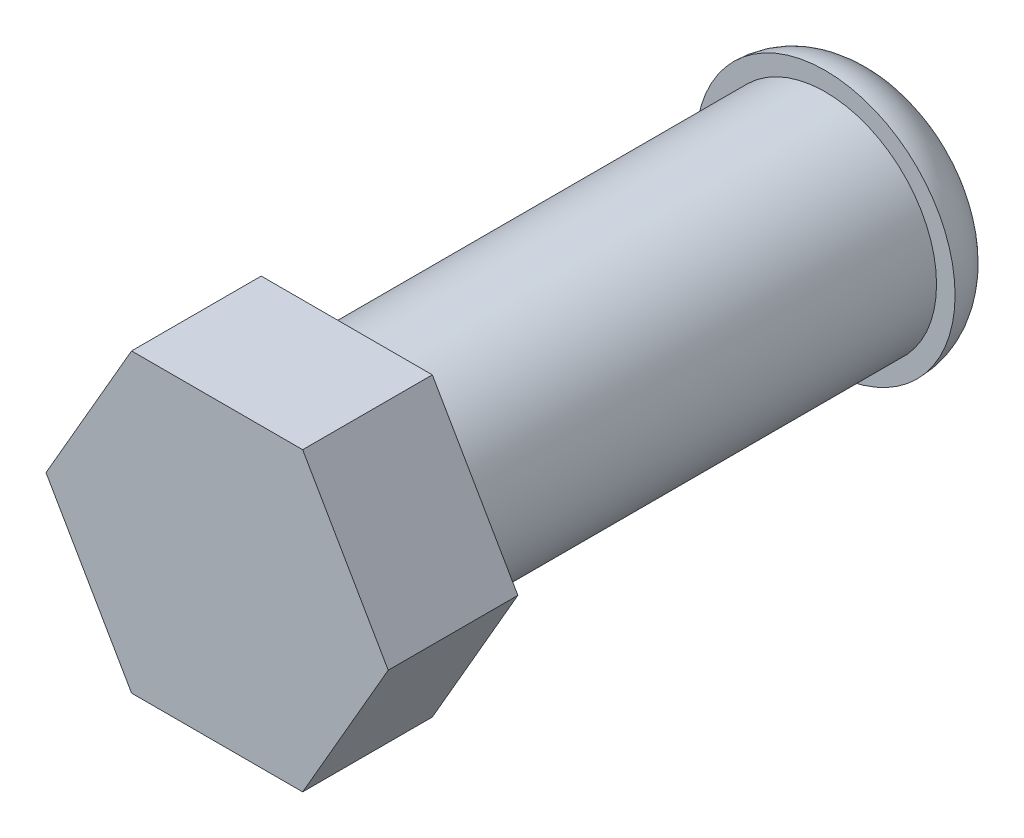
ISO-10303-21;
HEADER;
FILE_DESCRIPTION(('STEP AP214'),'2;1');
FILE_NAME('part.step','',(''),(''),'','','');
FILE_SCHEMA(('AUTOMOTIVE_DESIGN { 1 0 10303 214 1 1 1 1 }'));
ENDSEC;
DATA;
#1=APPLICATION_CONTEXT('core data for automotive mechanical design processes');
#2=APPLICATION_PROTOCOL_DEFINITION('international standard','automotive_design',2000,#1);
#3=PRODUCT_CONTEXT('',#1,'mechanical');
#4=PRODUCT('Part','Part','',(#3));
#5=PRODUCT_RELATED_PRODUCT_CATEGORY('part','',(#4));
#6=PRODUCT_DEFINITION_FORMATION('','',#4);
#7=PRODUCT_DEFINITION_CONTEXT('part definition',#1,'design');
#8=PRODUCT_DEFINITION('design','',#6,#7);
#9=PRODUCT_DEFINITION_SHAPE('','',#8);
#10=(LENGTH_UNIT() NAMED_UNIT(*) SI_UNIT(.MILLI.,.METRE.));
#11=(NAMED_UNIT(*) PLANE_ANGLE_UNIT() SI_UNIT($,.RADIAN.));
#12=(NAMED_UNIT(*) SI_UNIT($,.STERADIAN.) SOLID_ANGLE_UNIT());
#13=UNCERTAINTY_MEASURE_WITH_UNIT(LENGTH_MEASURE(1.E-05),#10,'distance_accuracy_value','');
#14=(GEOMETRIC_REPRESENTATION_CONTEXT(3) GLOBAL_UNCERTAINTY_ASSIGNED_CONTEXT((#13)) GLOBAL_UNIT_ASSIGNED_CONTEXT((#10,
#11,#12)) REPRESENTATION_CONTEXT('',''));
#15=CARTESIAN_POINT('',(0.,0.,0.));
#16=DIRECTION('',(0.,0.,1.));
#17=DIRECTION('',(1.,0.,0.));
#18=AXIS2_PLACEMENT_3D('',#15,#16,#17);
#19=CARTESIAN_POINT('',(0.,0.,25.84));
#20=DIRECTION('',(0.,0.,-1.));
#21=DIRECTION('',(-1.,0.,0.));
#22=AXIS2_PLACEMENT_3D('',#19,#20,#21);
#23=CYLINDRICAL_SURFACE('',#22,6.);
#24=CARTESIAN_POINT('',(0.,0.,25.84));
#25=DIRECTION('',(0.,0.,1.));
#26=DIRECTION('',(1.,0.,0.));
#27=AXIS2_PLACEMENT_3D('',#24,#25,#26);
#28=CIRCLE('',#27,6.);
#29=CARTESIAN_POINT('',(6.,0.,25.84));
#30=VERTEX_POINT('',#29);
#31=EDGE_CURVE('E43',#30,#30,#28,.T.);
#32=ORIENTED_EDGE('',*,*,#31,.F.);
#33=EDGE_LOOP('',(#32));
#34=FACE_BOUND('',#33,.T.);
#35=CARTESIAN_POINT('',(0.,0.,0.));
#36=DIRECTION('',(0.,0.,1.));
#37=DIRECTION('',(1.,0.,0.));
#38=AXIS2_PLACEMENT_3D('',#35,#36,#37);
#39=CIRCLE('',#38,6.);
#40=CARTESIAN_POINT('',(6.,0.,0.));
#41=VERTEX_POINT('',#40);
#42=EDGE_CURVE('E124',#41,#41,#39,.T.);
#43=ORIENTED_EDGE('',*,*,#42,.T.);
#44=EDGE_LOOP('',(#43));
#45=FACE_BOUND('',#44,.T.);
#46=ADVANCED_FACE('F34',(#34,#45),#23,.T.);
#47=CARTESIAN_POINT('',(4.61880215351701,-8.00000000000001,32.84));
#48=DIRECTION('',(-0.866025403784439,0.5,0.));
#49=DIRECTION('',(-0.5,-0.866025403784439,0.));
#50=AXIS2_PLACEMENT_3D('',#47,#48,#49);
#51=PLANE('',#50);
#52=DIRECTION('',(0.5,0.866025403784439,0.));
#53=VECTOR('',#52,1.);
#54=CARTESIAN_POINT('',(4.61880215351701,-8.00000000000001,25.84));
#55=LINE('',#54,#53);
#56=CARTESIAN_POINT('',(4.61880215351701,-8.00000000000001,25.84));
#57=VERTEX_POINT('',#56);
#58=CARTESIAN_POINT('',(9.23760430703402,0.,25.84));
#59=VERTEX_POINT('',#58);
#60=EDGE_CURVE('E120',#57,#59,#55,.T.);
#61=ORIENTED_EDGE('',*,*,#60,.T.);
#62=DIRECTION('',(0.,0.,-1.));
#63=VECTOR('',#62,1.);
#64=CARTESIAN_POINT('',(9.23760430703402,0.,32.84));
#65=LINE('',#64,#63);
#66=CARTESIAN_POINT('',(9.23760430703402,0.,32.84));
#67=VERTEX_POINT('',#66);
#68=EDGE_CURVE('E138',#67,#59,#65,.T.);
#69=ORIENTED_EDGE('',*,*,#68,.F.);
#70=DIRECTION('',(0.5,0.866025403784439,0.));
#71=VECTOR('',#70,1.);
#72=CARTESIAN_POINT('',(4.61880215351701,-8.00000000000001,32.84));
#73=LINE('',#72,#71);
#74=CARTESIAN_POINT('',(4.61880215351701,-8.00000000000001,32.84));
#75=VERTEX_POINT('',#74);
#76=EDGE_CURVE('E131',#75,#67,#73,.T.);
#77=ORIENTED_EDGE('',*,*,#76,.F.);
#78=DIRECTION('',(0.,0.,-1.));
#79=VECTOR('',#78,1.);
#80=CARTESIAN_POINT('',(4.61880215351701,-8.00000000000001,32.84));
#81=LINE('',#80,#79);
#82=EDGE_CURVE('E116',#75,#57,#81,.T.);
#83=ORIENTED_EDGE('',*,*,#82,.T.);
#84=EDGE_LOOP('',(#61,#69,#77,#83));
#85=FACE_BOUND('',#84,.T.);
#86=ADVANCED_FACE('F161',(#85),#51,.F.);
#87=CARTESIAN_POINT('',(9.23760430703402,0.,32.84));
#88=DIRECTION('',(-0.866025403784439,-0.5,0.));
#89=DIRECTION('',(0.5,-0.866025403784439,0.));
#90=AXIS2_PLACEMENT_3D('',#87,#88,#89);
#91=PLANE('',#90);
#92=DIRECTION('',(-0.5,0.866025403784439,0.));
#93=VECTOR('',#92,1.);
#94=CARTESIAN_POINT('',(9.23760430703402,0.,25.84));
#95=LINE('',#94,#93);
#96=CARTESIAN_POINT('',(4.61880215351701,8.00000000000001,25.84));
#97=VERTEX_POINT('',#96);
#98=EDGE_CURVE('E123',#59,#97,#95,.T.);
#99=ORIENTED_EDGE('',*,*,#98,.T.);
#100=DIRECTION('',(0.,0.,-1.));
#101=VECTOR('',#100,1.);
#102=CARTESIAN_POINT('',(4.61880215351701,8.00000000000001,32.84));
#103=LINE('',#102,#101);
#104=CARTESIAN_POINT('',(4.61880215351701,8.00000000000001,32.84));
#105=VERTEX_POINT('',#104);
#106=EDGE_CURVE('E135',#105,#97,#103,.T.);
#107=ORIENTED_EDGE('',*,*,#106,.F.);
#108=DIRECTION('',(-0.5,0.866025403784439,0.));
#109=VECTOR('',#108,1.);
#110=CARTESIAN_POINT('',(9.23760430703402,0.,32.84));
#111=LINE('',#110,#109);
#112=EDGE_CURVE('E89',#67,#105,#111,.T.);
#113=ORIENTED_EDGE('',*,*,#112,.F.);
#114=ORIENTED_EDGE('',*,*,#68,.T.);
#115=EDGE_LOOP('',(#99,#107,#113,#114));
#116=FACE_BOUND('',#115,.T.);
#117=ADVANCED_FACE('F153',(#116),#91,.F.);
#118=CARTESIAN_POINT('',(4.61880215351701,8.00000000000001,32.84));
#119=DIRECTION('',(0.,-1.,0.));
#120=DIRECTION('',(0.,0.,-1.));
#121=AXIS2_PLACEMENT_3D('',#118,#119,#120);
#122=PLANE('',#121);
#123=DIRECTION('',(-1.,0.,0.));
#124=VECTOR('',#123,1.);
#125=CARTESIAN_POINT('',(4.61880215351701,8.00000000000001,25.84));
#126=LINE('',#125,#124);
#127=CARTESIAN_POINT('',(-4.61880215351701,8.00000000000001,25.84));
#128=VERTEX_POINT('',#127);
#129=EDGE_CURVE('E126',#97,#128,#126,.T.);
#130=ORIENTED_EDGE('',*,*,#129,.T.);
#131=DIRECTION('',(0.,0.,-1.));
#132=VECTOR('',#131,1.);
#133=CARTESIAN_POINT('',(-4.61880215351701,8.00000000000001,32.84));
#134=LINE('',#133,#132);
#135=CARTESIAN_POINT('',(-4.61880215351701,8.00000000000001,32.84));
#136=VERTEX_POINT('',#135);
#137=EDGE_CURVE('E111',#136,#128,#134,.T.);
#138=ORIENTED_EDGE('',*,*,#137,.F.);
#139=DIRECTION('',(-1.,0.,0.));
#140=VECTOR('',#139,1.);
#141=CARTESIAN_POINT('',(4.61880215351701,8.00000000000001,32.84));
#142=LINE('',#141,#140);
#143=EDGE_CURVE('E102',#105,#136,#142,.T.);
#144=ORIENTED_EDGE('',*,*,#143,.F.);
#145=ORIENTED_EDGE('',*,*,#106,.T.);
#146=EDGE_LOOP('',(#130,#138,#144,#145));
#147=FACE_BOUND('',#146,.T.);
#148=ADVANCED_FACE('F156',(#147),#122,.F.);
#149=CARTESIAN_POINT('',(-4.61880215351701,8.00000000000001,32.84));
#150=DIRECTION('',(0.866025403784439,-0.5,0.));
#151=DIRECTION('',(0.5,0.866025403784439,0.));
#152=AXIS2_PLACEMENT_3D('',#149,#150,#151);
#153=PLANE('',#152);
#154=DIRECTION('',(-0.5,-0.866025403784439,0.));
#155=VECTOR('',#154,1.);
#156=CARTESIAN_POINT('',(-4.61880215351701,8.00000000000001,25.84));
#157=LINE('',#156,#155);
#158=CARTESIAN_POINT('',(-9.23760430703402,0.,25.84));
#159=VERTEX_POINT('',#158);
#160=EDGE_CURVE('E110',#128,#159,#157,.T.);
#161=ORIENTED_EDGE('',*,*,#160,.T.);
#162=DIRECTION('',(0.,0.,-1.));
#163=VECTOR('',#162,1.);
#164=CARTESIAN_POINT('',(-9.23760430703402,0.,32.84));
#165=LINE('',#164,#163);
#166=CARTESIAN_POINT('',(-9.23760430703402,0.,32.84));
#167=VERTEX_POINT('',#166);
#168=EDGE_CURVE('E107',#167,#159,#165,.T.);
#169=ORIENTED_EDGE('',*,*,#168,.F.);
#170=DIRECTION('',(-0.5,-0.866025403784439,0.));
#171=VECTOR('',#170,1.);
#172=CARTESIAN_POINT('',(-4.61880215351701,8.00000000000001,32.84));
#173=LINE('',#172,#171);
#174=EDGE_CURVE('E96',#136,#167,#173,.T.);
#175=ORIENTED_EDGE('',*,*,#174,.F.);
#176=ORIENTED_EDGE('',*,*,#137,.T.);
#177=EDGE_LOOP('',(#161,#169,#175,#176));
#178=FACE_BOUND('',#177,.T.);
#179=ADVANCED_FACE('F108',(#178),#153,.F.);
#180=CARTESIAN_POINT('',(-9.23760430703402,0.,32.84));
#181=DIRECTION('',(0.866025403784438,0.5,0.));
#182=DIRECTION('',(-0.5,0.866025403784439,0.));
#183=AXIS2_PLACEMENT_3D('',#180,#181,#182);
#184=PLANE('',#183);
#185=DIRECTION('',(0.5,-0.866025403784438,0.));
#186=VECTOR('',#185,1.);
#187=CARTESIAN_POINT('',(-9.23760430703402,0.,25.84));
#188=LINE('',#187,#186);
#189=CARTESIAN_POINT('',(-4.61880215351701,-8.00000000000001,25.84));
#190=VERTEX_POINT('',#189);
#191=EDGE_CURVE('E74',#159,#190,#188,.T.);
#192=ORIENTED_EDGE('',*,*,#191,.T.);
#193=DIRECTION('',(0.,0.,-1.));
#194=VECTOR('',#193,1.);
#195=CARTESIAN_POINT('',(-4.61880215351701,-8.00000000000001,32.84));
#196=LINE('',#195,#194);
#197=CARTESIAN_POINT('',(-4.61880215351701,-8.00000000000001,32.84));
#198=VERTEX_POINT('',#197);
#199=EDGE_CURVE('E112',#198,#190,#196,.T.);
#200=ORIENTED_EDGE('',*,*,#199,.F.);
#201=DIRECTION('',(0.5,-0.866025403784438,0.));
#202=VECTOR('',#201,1.);
#203=CARTESIAN_POINT('',(-9.23760430703402,0.,32.84));
#204=LINE('',#203,#202);
#205=EDGE_CURVE('E100',#167,#198,#204,.T.);
#206=ORIENTED_EDGE('',*,*,#205,.F.);
#207=ORIENTED_EDGE('',*,*,#168,.T.);
#208=EDGE_LOOP('',(#192,#200,#206,#207));
#209=FACE_BOUND('',#208,.T.);
#210=ADVANCED_FACE('F114',(#209),#184,.F.);
#211=CARTESIAN_POINT('',(-4.61880215351701,-8.00000000000001,32.84));
#212=DIRECTION('',(0.,1.,0.));
#213=DIRECTION('',(0.,0.,1.));
#214=AXIS2_PLACEMENT_3D('',#211,#212,#213);
#215=PLANE('',#214);
#216=DIRECTION('',(1.,0.,0.));
#217=VECTOR('',#216,1.);
#218=CARTESIAN_POINT('',(-4.61880215351701,-8.00000000000001,25.84));
#219=LINE('',#218,#217);
#220=EDGE_CURVE('E80',#190,#57,#219,.T.);
#221=ORIENTED_EDGE('',*,*,#220,.T.);
#222=ORIENTED_EDGE('',*,*,#82,.F.);
#223=DIRECTION('',(1.,0.,0.));
#224=VECTOR('',#223,1.);
#225=CARTESIAN_POINT('',(-4.61880215351701,-8.00000000000001,32.84));
#226=LINE('',#225,#224);
#227=EDGE_CURVE('E51',#198,#75,#226,.T.);
#228=ORIENTED_EDGE('',*,*,#227,.F.);
#229=ORIENTED_EDGE('',*,*,#199,.T.);
#230=EDGE_LOOP('',(#221,#222,#228,#229));
#231=FACE_BOUND('',#230,.T.);
#232=ADVANCED_FACE('F162',(#231),#215,.F.);
#233=CARTESIAN_POINT('',(0.,0.,32.84));
#234=DIRECTION('',(0.,0.,1.));
#235=DIRECTION('',(1.,0.,0.));
#236=AXIS2_PLACEMENT_3D('',#233,#234,#235);
#237=PLANE('',#236);
#238=ORIENTED_EDGE('',*,*,#76,.T.);
#239=ORIENTED_EDGE('',*,*,#112,.T.);
#240=ORIENTED_EDGE('',*,*,#143,.T.);
#241=ORIENTED_EDGE('',*,*,#174,.T.);
#242=ORIENTED_EDGE('',*,*,#205,.T.);
#243=ORIENTED_EDGE('',*,*,#227,.T.);
#244=EDGE_LOOP('',(#238,#239,#240,#241,#242,#243));
#245=FACE_BOUND('',#244,.T.);
#246=ADVANCED_FACE('F98',(#245),#237,.T.);
#247=CARTESIAN_POINT('',(0.,0.,25.84));
#248=DIRECTION('',(0.,0.,1.));
#249=DIRECTION('',(1.,0.,0.));
#250=AXIS2_PLACEMENT_3D('',#247,#248,#249);
#251=PLANE('',#250);
#252=ORIENTED_EDGE('',*,*,#31,.T.);
#253=EDGE_LOOP('',(#252));
#254=FACE_BOUND('',#253,.T.);
#255=ORIENTED_EDGE('',*,*,#60,.F.);
#256=ORIENTED_EDGE('',*,*,#220,.F.);
#257=ORIENTED_EDGE('',*,*,#191,.F.);
#258=ORIENTED_EDGE('',*,*,#160,.F.);
#259=ORIENTED_EDGE('',*,*,#129,.F.);
#260=ORIENTED_EDGE('',*,*,#98,.F.);
#261=EDGE_LOOP('',(#255,#256,#257,#258,#259,#260));
#262=FACE_BOUND('',#261,.T.);
#263=ADVANCED_FACE('F159',(#254,#262),#251,.F.);
#264=CARTESIAN_POINT('',(0.,0.,-3.));
#265=DIRECTION('',(0.,0.,-1.));
#266=DIRECTION('',(-1.,0.,0.));
#267=AXIS2_PLACEMENT_3D('',#264,#265,#266);
#268=PLANE('',#267);
#269=CARTESIAN_POINT('',(0.,0.,-3.));
#270=DIRECTION('',(0.,0.,-1.));
#271=DIRECTION('',(-1.,0.,0.));
#272=AXIS2_PLACEMENT_3D('',#269,#270,#271);
#273=CIRCLE('',#272,4.);
#274=CARTESIAN_POINT('',(-4.,0.,-3.));
#275=VERTEX_POINT('',#274);
#276=EDGE_CURVE('E11',#275,#275,#273,.T.);
#277=ORIENTED_EDGE('',*,*,#276,.T.);
#278=EDGE_LOOP('',(#277));
#279=FACE_BOUND('',#278,.T.);
#280=ADVANCED_FACE('F212',(#279),#268,.T.);
#281=CARTESIAN_POINT('',(0.,0.,0.));
#282=DIRECTION('',(0.,0.,-1.));
#283=DIRECTION('',(-1.,0.,0.));
#284=AXIS2_PLACEMENT_3D('',#281,#282,#283);
#285=PLANE('',#284);
#286=ORIENTED_EDGE('',*,*,#42,.F.);
#287=EDGE_LOOP('',(#286));
#288=FACE_BOUND('',#287,.T.);
#289=CARTESIAN_POINT('',(0.,0.,0.));
#290=DIRECTION('',(0.,0.,-1.));
#291=DIRECTION('',(-1.,0.,0.));
#292=AXIS2_PLACEMENT_3D('',#289,#290,#291);
#293=CIRCLE('',#292,7.);
#294=CARTESIAN_POINT('',(-7.,0.,0.));
#295=VERTEX_POINT('',#294);
#296=EDGE_CURVE('E142',#295,#295,#293,.T.);
#297=ORIENTED_EDGE('',*,*,#296,.F.);
#298=EDGE_LOOP('',(#297));
#299=FACE_BOUND('',#298,.T.);
#300=ADVANCED_FACE('F219',(#288,#299),#285,.F.);
#301=CARTESIAN_POINT('',(0.,0.,0.));
#302=DIRECTION('',(0.,0.,-1.));
#303=DIRECTION('',(-1.,0.,0.));
#304=AXIS2_PLACEMENT_3D('',#301,#302,#303);
#305=TOROIDAL_SURFACE('',#304,4.,3.);
#306=ORIENTED_EDGE('',*,*,#296,.T.);
#307=EDGE_LOOP('',(#306));
#308=FACE_BOUND('',#307,.T.);
#309=ORIENTED_EDGE('',*,*,#276,.F.);
#310=EDGE_LOOP('',(#309));
#311=FACE_BOUND('',#310,.T.);
#312=ADVANCED_FACE('F36',(#308,#311),#305,.T.);
#313=CLOSED_SHELL('',(#46,#86,#117,#148,#179,#210,#232,#246,#263,#280,#300,#312));
#314=MANIFOLD_SOLID_BREP('B2',#313);
#315=ADVANCED_BREP_SHAPE_REPRESENTATION('',(#18,#314),#14);
#316=SHAPE_DEFINITION_REPRESENTATION(#9,#315);
ENDSEC;
END-ISO-10303-21;
